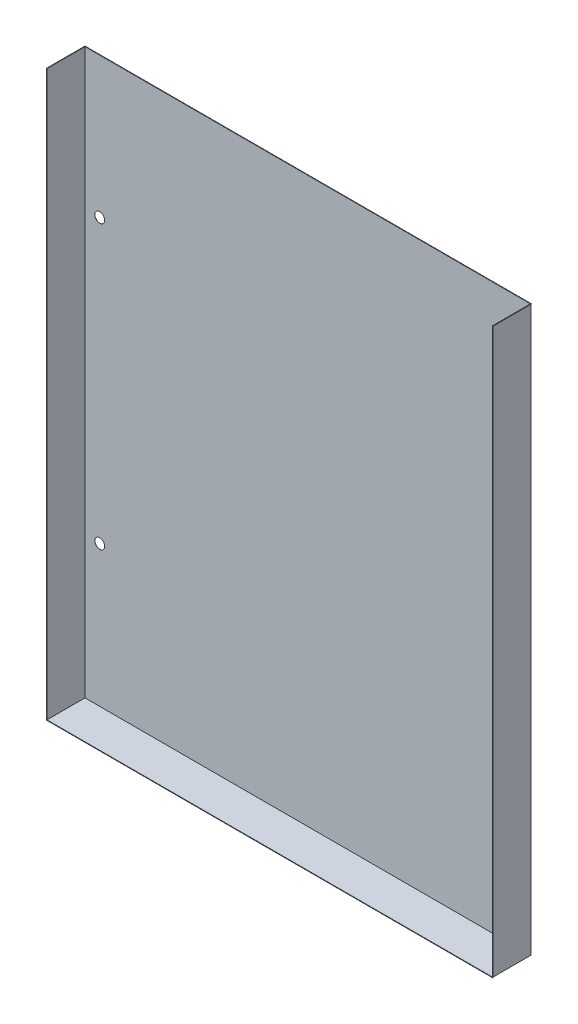
ISO-10303-21;
HEADER;
FILE_DESCRIPTION(('STEP AP214'),'2;1');
FILE_NAME('part.step','',(''),(''),'','','');
FILE_SCHEMA(('AUTOMOTIVE_DESIGN { 1 0 10303 214 1 1 1 1 }'));
ENDSEC;
DATA;
#1=APPLICATION_CONTEXT('core data for automotive mechanical design processes');
#2=APPLICATION_PROTOCOL_DEFINITION('international standard','automotive_design',2000,#1);
#3=PRODUCT_CONTEXT('',#1,'mechanical');
#4=PRODUCT('Part','Part','',(#3));
#5=PRODUCT_RELATED_PRODUCT_CATEGORY('part','',(#4));
#6=PRODUCT_DEFINITION_FORMATION('','',#4);
#7=PRODUCT_DEFINITION_CONTEXT('part definition',#1,'design');
#8=PRODUCT_DEFINITION('design','',#6,#7);
#9=PRODUCT_DEFINITION_SHAPE('','',#8);
#10=(LENGTH_UNIT() NAMED_UNIT(*) SI_UNIT(.MILLI.,.METRE.));
#11=(NAMED_UNIT(*) PLANE_ANGLE_UNIT() SI_UNIT($,.RADIAN.));
#12=(NAMED_UNIT(*) SI_UNIT($,.STERADIAN.) SOLID_ANGLE_UNIT());
#13=UNCERTAINTY_MEASURE_WITH_UNIT(LENGTH_MEASURE(1.E-05),#10,'distance_accuracy_value','');
#14=(GEOMETRIC_REPRESENTATION_CONTEXT(3) GLOBAL_UNCERTAINTY_ASSIGNED_CONTEXT((#13)) GLOBAL_UNIT_ASSIGNED_CONTEXT((#10,
#11,#12)) REPRESENTATION_CONTEXT('',''));
#15=CARTESIAN_POINT('',(0.,0.,0.));
#16=DIRECTION('',(0.,0.,1.));
#17=DIRECTION('',(1.,0.,0.));
#18=AXIS2_PLACEMENT_3D('',#15,#16,#17);
#19=CARTESIAN_POINT('',(-83.71996294,56.94427919,0.0686));
#20=DIRECTION('',(0.,0.,-1.));
#21=DIRECTION('',(-1.,0.,0.));
#22=AXIS2_PLACEMENT_3D('',#19,#20,#21);
#23=CYLINDRICAL_SURFACE('',#22,2.);
#24=CARTESIAN_POINT('',(-83.71996294,56.94427919,0.0686));
#25=DIRECTION('',(0.,0.,1.));
#26=DIRECTION('',(1.,0.,0.));
#27=AXIS2_PLACEMENT_3D('',#24,#25,#26);
#28=CIRCLE('',#27,2.);
#29=CARTESIAN_POINT('',(-81.71996294,56.94427919,0.0686));
#30=VERTEX_POINT('',#29);
#31=EDGE_CURVE('E361',#30,#30,#28,.T.);
#32=ORIENTED_EDGE('',*,*,#31,.T.);
#33=EDGE_LOOP('',(#32));
#34=FACE_BOUND('',#33,.T.);
#35=CARTESIAN_POINT('',(-83.71996294,56.94427919,0.));
#36=DIRECTION('',(0.,0.,1.));
#37=DIRECTION('',(1.,0.,0.));
#38=AXIS2_PLACEMENT_3D('',#35,#36,#37);
#39=CIRCLE('',#38,2.);
#40=CARTESIAN_POINT('',(-81.71996294,56.94427919,0.));
#41=VERTEX_POINT('',#40);
#42=EDGE_CURVE('E366',#41,#41,#39,.T.);
#43=ORIENTED_EDGE('',*,*,#42,.F.);
#44=EDGE_LOOP('',(#43));
#45=FACE_BOUND('',#44,.T.);
#46=ADVANCED_FACE('F37',(#34,#45),#23,.F.);
#47=CARTESIAN_POINT('',(-83.71996294,-56.7081132,0.0686));
#48=DIRECTION('',(0.,0.,-1.));
#49=DIRECTION('',(-1.,0.,0.));
#50=AXIS2_PLACEMENT_3D('',#47,#48,#49);
#51=CYLINDRICAL_SURFACE('',#50,2.);
#52=CARTESIAN_POINT('',(-83.71996294,-56.7081132,0.0686));
#53=DIRECTION('',(0.,0.,1.));
#54=DIRECTION('',(1.,0.,0.));
#55=AXIS2_PLACEMENT_3D('',#52,#53,#54);
#56=CIRCLE('',#55,2.);
#57=CARTESIAN_POINT('',(-81.71996294,-56.7081132,0.0686));
#58=VERTEX_POINT('',#57);
#59=EDGE_CURVE('E358',#58,#58,#56,.T.);
#60=ORIENTED_EDGE('',*,*,#59,.T.);
#61=EDGE_LOOP('',(#60));
#62=FACE_BOUND('',#61,.T.);
#63=CARTESIAN_POINT('',(-83.71996294,-56.7081132,0.));
#64=DIRECTION('',(0.,0.,1.));
#65=DIRECTION('',(1.,0.,0.));
#66=AXIS2_PLACEMENT_3D('',#63,#64,#65);
#67=CIRCLE('',#66,2.);
#68=CARTESIAN_POINT('',(-81.71996294,-56.7081132,0.));
#69=VERTEX_POINT('',#68);
#70=EDGE_CURVE('E264',#69,#69,#67,.T.);
#71=ORIENTED_EDGE('',*,*,#70,.F.);
#72=EDGE_LOOP('',(#71));
#73=FACE_BOUND('',#72,.T.);
#74=ADVANCED_FACE('F39',(#62,#73),#51,.F.);
#75=CARTESIAN_POINT('',(0.,0.,0.0686));
#76=DIRECTION('',(0.,0.,1.));
#77=DIRECTION('',(1.,0.,0.));
#78=AXIS2_PLACEMENT_3D('',#75,#76,#77);
#79=PLANE('',#78);
#80=ORIENTED_EDGE('',*,*,#59,.F.);
#81=EDGE_LOOP('',(#80));
#82=FACE_BOUND('',#81,.T.);
#83=ORIENTED_EDGE('',*,*,#31,.F.);
#84=EDGE_LOOP('',(#83));
#85=FACE_BOUND('',#84,.T.);
#86=DIRECTION('',(0.,1.,0.));
#87=VECTOR('',#86,1.);
#88=CARTESIAN_POINT('',(89.6514,0.,0.0686));
#89=LINE('',#88,#87);
#90=CARTESIAN_POINT('',(89.6514,-113.4657,0.0686000000000037));
#91=VERTEX_POINT('',#90);
#92=CARTESIAN_POINT('',(89.6514,113.5343,0.0686000000000003));
#93=VERTEX_POINT('',#92);
#94=EDGE_CURVE('E123',#91,#93,#89,.T.);
#95=ORIENTED_EDGE('',*,*,#94,.T.);
#96=DIRECTION('',(1.,0.,0.));
#97=VECTOR('',#96,1.);
#98=CARTESIAN_POINT('',(-89.6514,113.5343,0.0686000000000003));
#99=LINE('',#98,#97);
#100=CARTESIAN_POINT('',(-89.6514,113.5343,0.0686000000000003));
#101=VERTEX_POINT('',#100);
#102=EDGE_CURVE('E269',#101,#93,#99,.T.);
#103=ORIENTED_EDGE('',*,*,#102,.F.);
#104=DIRECTION('',(0.,1.,0.));
#105=VECTOR('',#104,1.);
#106=CARTESIAN_POINT('',(-89.6514,0.,0.0686));
#107=LINE('',#106,#105);
#108=CARTESIAN_POINT('',(-89.6514,-113.4657,0.0686000000000037));
#109=VERTEX_POINT('',#108);
#110=EDGE_CURVE('E46',#109,#101,#107,.T.);
#111=ORIENTED_EDGE('',*,*,#110,.F.);
#112=DIRECTION('',(1.,0.,0.));
#113=VECTOR('',#112,1.);
#114=CARTESIAN_POINT('',(0.,-113.4657,0.0686));
#115=LINE('',#114,#113);
#116=EDGE_CURVE('E11',#109,#91,#115,.T.);
#117=ORIENTED_EDGE('',*,*,#116,.T.);
#118=EDGE_LOOP('',(#95,#103,#111,#117));
#119=FACE_BOUND('',#118,.T.);
#120=CARTESIAN_POINT('',(83.71996294,-56.7081132,0.0686));
#121=DIRECTION('',(0.,0.,-1.));
#122=DIRECTION('',(-1.,0.,0.));
#123=AXIS2_PLACEMENT_3D('',#120,#121,#122);
#124=CIRCLE('',#123,2.);
#125=CARTESIAN_POINT('',(81.71996294,-56.7081132,0.0686));
#126=VERTEX_POINT('',#125);
#127=EDGE_CURVE('E154',#126,#126,#124,.T.);
#128=ORIENTED_EDGE('',*,*,#127,.T.);
#129=EDGE_LOOP('',(#128));
#130=FACE_BOUND('',#129,.T.);
#131=CARTESIAN_POINT('',(83.71996294,56.94427919,0.0686));
#132=DIRECTION('',(0.,0.,-1.));
#133=DIRECTION('',(-1.,0.,0.));
#134=AXIS2_PLACEMENT_3D('',#131,#132,#133);
#135=CIRCLE('',#134,2.);
#136=CARTESIAN_POINT('',(81.71996294,56.94427919,0.0686));
#137=VERTEX_POINT('',#136);
#138=EDGE_CURVE('E128',#137,#137,#135,.T.);
#139=ORIENTED_EDGE('',*,*,#138,.T.);
#140=EDGE_LOOP('',(#139));
#141=FACE_BOUND('',#140,.T.);
#142=ADVANCED_FACE('F290',(#82,#85,#119,#130,#141),#79,.T.);
#143=CARTESIAN_POINT('',(0.,0.,0.));
#144=DIRECTION('',(0.,0.,1.));
#145=DIRECTION('',(1.,0.,0.));
#146=AXIS2_PLACEMENT_3D('',#143,#144,#145);
#147=PLANE('',#146);
#148=DIRECTION('',(0.,-1.,0.));
#149=VECTOR('',#148,1.);
#150=CARTESIAN_POINT('',(89.72,113.4657,0.));
#151=LINE('',#150,#149);
#152=CARTESIAN_POINT('',(89.72,113.4657,0.));
#153=VERTEX_POINT('',#152);
#154=CARTESIAN_POINT('',(89.72,-113.5343,0.));
#155=VERTEX_POINT('',#154);
#156=EDGE_CURVE('E170',#153,#155,#151,.T.);
#157=ORIENTED_EDGE('',*,*,#156,.T.);
#158=DIRECTION('',(1.,0.,0.));
#159=VECTOR('',#158,1.);
#160=CARTESIAN_POINT('',(-89.72,-113.5343,0.));
#161=LINE('',#160,#159);
#162=CARTESIAN_POINT('',(-89.72,-113.5343,0.));
#163=VERTEX_POINT('',#162);
#164=EDGE_CURVE('E349',#163,#155,#161,.T.);
#165=ORIENTED_EDGE('',*,*,#164,.F.);
#166=DIRECTION('',(0.,-1.,0.));
#167=VECTOR('',#166,1.);
#168=CARTESIAN_POINT('',(-89.72,113.4657,0.));
#169=LINE('',#168,#167);
#170=CARTESIAN_POINT('',(-89.72,113.4657,0.));
#171=VERTEX_POINT('',#170);
#172=EDGE_CURVE('E351',#171,#163,#169,.T.);
#173=ORIENTED_EDGE('',*,*,#172,.F.);
#174=DIRECTION('',(1.,0.,0.));
#175=VECTOR('',#174,1.);
#176=CARTESIAN_POINT('',(0.,113.4657,0.));
#177=LINE('',#176,#175);
#178=EDGE_CURVE('E73',#171,#153,#177,.T.);
#179=ORIENTED_EDGE('',*,*,#178,.T.);
#180=EDGE_LOOP('',(#157,#165,#173,#179));
#181=FACE_BOUND('',#180,.T.);
#182=ORIENTED_EDGE('',*,*,#70,.T.);
#183=EDGE_LOOP('',(#182));
#184=FACE_BOUND('',#183,.T.);
#185=ORIENTED_EDGE('',*,*,#42,.T.);
#186=EDGE_LOOP('',(#185));
#187=FACE_BOUND('',#186,.T.);
#188=CARTESIAN_POINT('',(83.71996294,-56.7081132,0.));
#189=DIRECTION('',(0.,0.,-1.));
#190=DIRECTION('',(-1.,0.,0.));
#191=AXIS2_PLACEMENT_3D('',#188,#189,#190);
#192=CIRCLE('',#191,2.);
#193=CARTESIAN_POINT('',(81.71996294,-56.7081132,0.));
#194=VERTEX_POINT('',#193);
#195=EDGE_CURVE('E155',#194,#194,#192,.T.);
#196=ORIENTED_EDGE('',*,*,#195,.F.);
#197=EDGE_LOOP('',(#196));
#198=FACE_BOUND('',#197,.T.);
#199=CARTESIAN_POINT('',(83.71996294,56.94427919,0.));
#200=DIRECTION('',(0.,0.,-1.));
#201=DIRECTION('',(-1.,0.,0.));
#202=AXIS2_PLACEMENT_3D('',#199,#200,#201);
#203=CIRCLE('',#202,2.);
#204=CARTESIAN_POINT('',(81.71996294,56.94427919,0.));
#205=VERTEX_POINT('',#204);
#206=EDGE_CURVE('E151',#205,#205,#203,.T.);
#207=ORIENTED_EDGE('',*,*,#206,.F.);
#208=EDGE_LOOP('',(#207));
#209=FACE_BOUND('',#208,.T.);
#210=ADVANCED_FACE('F295',(#181,#184,#187,#198,#209),#147,.F.);
#211=CARTESIAN_POINT('',(0.,-113.4657,15.29686));
#212=DIRECTION('',(0.,-1.,0.));
#213=DIRECTION('',(0.,0.,-1.));
#214=AXIS2_PLACEMENT_3D('',#211,#212,#213);
#215=PLANE('',#214);
#216=ORIENTED_EDGE('',*,*,#116,.F.);
#217=DIRECTION('',(0.,0.,-1.));
#218=VECTOR('',#217,1.);
#219=CARTESIAN_POINT('',(-89.6514,-113.4657,15.29686));
#220=LINE('',#219,#218);
#221=CARTESIAN_POINT('',(-89.6514,-113.4657,15.36546));
#222=VERTEX_POINT('',#221);
#223=EDGE_CURVE('E259',#222,#109,#220,.T.);
#224=ORIENTED_EDGE('',*,*,#223,.F.);
#225=DIRECTION('',(-1.,0.,0.));
#226=VECTOR('',#225,1.);
#227=CARTESIAN_POINT('',(-89.6514,-113.4657,15.36546));
#228=LINE('',#227,#226);
#229=CARTESIAN_POINT('',(89.6514,-113.4657,15.36546));
#230=VERTEX_POINT('',#229);
#231=EDGE_CURVE('E137',#230,#222,#228,.T.);
#232=ORIENTED_EDGE('',*,*,#231,.F.);
#233=DIRECTION('',(0.,0.,-1.));
#234=VECTOR('',#233,1.);
#235=CARTESIAN_POINT('',(89.6514,-113.4657,15.29686));
#236=LINE('',#235,#234);
#237=EDGE_CURVE('E167',#230,#91,#236,.T.);
#238=ORIENTED_EDGE('',*,*,#237,.T.);
#239=EDGE_LOOP('',(#216,#224,#232,#238));
#240=FACE_BOUND('',#239,.T.);
#241=ADVANCED_FACE('F260',(#240),#215,.F.);
#242=CARTESIAN_POINT('',(-89.6514,-113.4657,15.29686));
#243=DIRECTION('',(-1.,0.,0.));
#244=DIRECTION('',(0.,0.,1.));
#245=AXIS2_PLACEMENT_3D('',#242,#243,#244);
#246=PLANE('',#245);
#247=ORIENTED_EDGE('',*,*,#110,.T.);
#248=DIRECTION('',(0.,0.,-1.));
#249=VECTOR('',#248,1.);
#250=CARTESIAN_POINT('',(-89.6514,113.5343,15.29686));
#251=LINE('',#250,#249);
#252=CARTESIAN_POINT('',(-89.6514,113.5343,15.36546));
#253=VERTEX_POINT('',#252);
#254=EDGE_CURVE('E116',#253,#101,#251,.T.);
#255=ORIENTED_EDGE('',*,*,#254,.F.);
#256=DIRECTION('',(0.,1.,0.));
#257=VECTOR('',#256,1.);
#258=CARTESIAN_POINT('',(-89.6514,113.5343,15.36546));
#259=LINE('',#258,#257);
#260=EDGE_CURVE('E125',#222,#253,#259,.T.);
#261=ORIENTED_EDGE('',*,*,#260,.F.);
#262=ORIENTED_EDGE('',*,*,#223,.T.);
#263=EDGE_LOOP('',(#247,#255,#261,#262));
#264=FACE_BOUND('',#263,.T.);
#265=ADVANCED_FACE('F266',(#264),#246,.F.);
#266=CARTESIAN_POINT('',(-89.72,113.4657,15.29686));
#267=DIRECTION('',(1.,0.,0.));
#268=DIRECTION('',(0.,0.,-1.));
#269=AXIS2_PLACEMENT_3D('',#266,#267,#268);
#270=PLANE('',#269);
#271=ORIENTED_EDGE('',*,*,#172,.T.);
#272=DIRECTION('',(0.,0.,-1.));
#273=VECTOR('',#272,1.);
#274=CARTESIAN_POINT('',(-89.72,-113.5343,15.29686));
#275=LINE('',#274,#273);
#276=CARTESIAN_POINT('',(-89.72,-113.5343,15.29686));
#277=VERTEX_POINT('',#276);
#278=EDGE_CURVE('E61',#277,#163,#275,.T.);
#279=ORIENTED_EDGE('',*,*,#278,.F.);
#280=DIRECTION('',(0.,-1.,0.));
#281=VECTOR('',#280,1.);
#282=CARTESIAN_POINT('',(-89.72,113.4657,15.29686));
#283=LINE('',#282,#281);
#284=CARTESIAN_POINT('',(-89.72,113.4657,15.29686));
#285=VERTEX_POINT('',#284);
#286=EDGE_CURVE('E347',#285,#277,#283,.T.);
#287=ORIENTED_EDGE('',*,*,#286,.F.);
#288=DIRECTION('',(0.,0.,-1.));
#289=VECTOR('',#288,1.);
#290=CARTESIAN_POINT('',(-89.72,113.4657,15.29686));
#291=LINE('',#290,#289);
#292=EDGE_CURVE('E77',#285,#171,#291,.T.);
#293=ORIENTED_EDGE('',*,*,#292,.T.);
#294=EDGE_LOOP('',(#271,#279,#287,#293));
#295=FACE_BOUND('',#294,.T.);
#296=ADVANCED_FACE('F306',(#295),#270,.F.);
#297=CARTESIAN_POINT('',(-89.72,-113.5343,15.29686));
#298=DIRECTION('',(0.,1.,0.));
#299=DIRECTION('',(0.,0.,1.));
#300=AXIS2_PLACEMENT_3D('',#297,#298,#299);
#301=PLANE('',#300);
#302=ORIENTED_EDGE('',*,*,#164,.T.);
#303=DIRECTION('',(0.,0.,-1.));
#304=VECTOR('',#303,1.);
#305=CARTESIAN_POINT('',(89.72,-113.5343,15.29686));
#306=LINE('',#305,#304);
#307=CARTESIAN_POINT('',(89.72,-113.5343,15.29686));
#308=VERTEX_POINT('',#307);
#309=EDGE_CURVE('E157',#308,#155,#306,.T.);
#310=ORIENTED_EDGE('',*,*,#309,.F.);
#311=DIRECTION('',(1.,0.,0.));
#312=VECTOR('',#311,1.);
#313=CARTESIAN_POINT('',(-89.72,-113.5343,15.29686));
#314=LINE('',#313,#312);
#315=EDGE_CURVE('E346',#277,#308,#314,.T.);
#316=ORIENTED_EDGE('',*,*,#315,.F.);
#317=ORIENTED_EDGE('',*,*,#278,.T.);
#318=EDGE_LOOP('',(#302,#310,#316,#317));
#319=FACE_BOUND('',#318,.T.);
#320=ADVANCED_FACE('F309',(#319),#301,.F.);
#321=CARTESIAN_POINT('',(0.,113.4657,0.));
#322=DIRECTION('',(0.,-1.,0.));
#323=DIRECTION('',(0.,0.,-1.));
#324=AXIS2_PLACEMENT_3D('',#321,#322,#323);
#325=PLANE('',#324);
#326=ORIENTED_EDGE('',*,*,#178,.F.);
#327=ORIENTED_EDGE('',*,*,#292,.F.);
#328=DIRECTION('',(1.,0.,0.));
#329=VECTOR('',#328,1.);
#330=CARTESIAN_POINT('',(-89.8724,113.4657,15.29686));
#331=LINE('',#330,#329);
#332=CARTESIAN_POINT('',(-89.8724,113.4657,15.29686));
#333=VERTEX_POINT('',#332);
#334=EDGE_CURVE('E110',#333,#285,#331,.T.);
#335=ORIENTED_EDGE('',*,*,#334,.F.);
#336=DIRECTION('',(0.,0.,1.));
#337=VECTOR('',#336,1.);
#338=CARTESIAN_POINT('',(-89.8724,113.4657,15.29686));
#339=LINE('',#338,#337);
#340=CARTESIAN_POINT('',(-89.8724,113.4657,-0.1524));
#341=VERTEX_POINT('',#340);
#342=EDGE_CURVE('E100',#341,#333,#339,.T.);
#343=ORIENTED_EDGE('',*,*,#342,.F.);
#344=DIRECTION('',(-1.,0.,0.));
#345=VECTOR('',#344,1.);
#346=CARTESIAN_POINT('',(-89.8724,113.4657,-0.1524));
#347=LINE('',#346,#345);
#348=CARTESIAN_POINT('',(89.8724,113.4657,-0.1524));
#349=VERTEX_POINT('',#348);
#350=EDGE_CURVE('E111',#349,#341,#347,.T.);
#351=ORIENTED_EDGE('',*,*,#350,.F.);
#352=DIRECTION('',(0.,0.,1.));
#353=VECTOR('',#352,1.);
#354=CARTESIAN_POINT('',(89.8724,113.4657,15.29686));
#355=LINE('',#354,#353);
#356=CARTESIAN_POINT('',(89.8724,113.4657,15.29686));
#357=VERTEX_POINT('',#356);
#358=EDGE_CURVE('E179',#349,#357,#355,.T.);
#359=ORIENTED_EDGE('',*,*,#358,.T.);
#360=DIRECTION('',(-1.,0.,0.));
#361=VECTOR('',#360,1.);
#362=CARTESIAN_POINT('',(89.8724,113.4657,15.29686));
#363=LINE('',#362,#361);
#364=CARTESIAN_POINT('',(89.72,113.4657,15.29686));
#365=VERTEX_POINT('',#364);
#366=EDGE_CURVE('E183',#357,#365,#363,.T.);
#367=ORIENTED_EDGE('',*,*,#366,.T.);
#368=DIRECTION('',(0.,0.,-1.));
#369=VECTOR('',#368,1.);
#370=CARTESIAN_POINT('',(89.72,113.4657,15.29686));
#371=LINE('',#370,#369);
#372=EDGE_CURVE('E165',#365,#153,#371,.T.);
#373=ORIENTED_EDGE('',*,*,#372,.T.);
#374=EDGE_LOOP('',(#326,#327,#335,#343,#351,#359,#367,#373));
#375=FACE_BOUND('',#374,.T.);
#376=ADVANCED_FACE('F113',(#375),#325,.T.);
#377=CARTESIAN_POINT('',(-89.8724,113.5343,-0.1524));
#378=DIRECTION('',(0.,0.,1.));
#379=DIRECTION('',(1.,0.,0.));
#380=AXIS2_PLACEMENT_3D('',#377,#378,#379);
#381=PLANE('',#380);
#382=ORIENTED_EDGE('',*,*,#350,.T.);
#383=DIRECTION('',(0.,-1.,0.));
#384=VECTOR('',#383,1.);
#385=CARTESIAN_POINT('',(-89.8724,113.5343,-0.1524));
#386=LINE('',#385,#384);
#387=CARTESIAN_POINT('',(-89.8724,113.5343,-0.1524));
#388=VERTEX_POINT('',#387);
#389=EDGE_CURVE('E108',#388,#341,#386,.T.);
#390=ORIENTED_EDGE('',*,*,#389,.F.);
#391=DIRECTION('',(-1.,0.,0.));
#392=VECTOR('',#391,1.);
#393=CARTESIAN_POINT('',(-89.8724,113.5343,-0.1524));
#394=LINE('',#393,#392);
#395=CARTESIAN_POINT('',(89.8724,113.5343,-0.1524));
#396=VERTEX_POINT('',#395);
#397=EDGE_CURVE('E85',#396,#388,#394,.T.);
#398=ORIENTED_EDGE('',*,*,#397,.F.);
#399=DIRECTION('',(0.,-1.,0.));
#400=VECTOR('',#399,1.);
#401=CARTESIAN_POINT('',(89.8724,113.5343,-0.1524));
#402=LINE('',#401,#400);
#403=EDGE_CURVE('E173',#396,#349,#402,.T.);
#404=ORIENTED_EDGE('',*,*,#403,.T.);
#405=EDGE_LOOP('',(#382,#390,#398,#404));
#406=FACE_BOUND('',#405,.T.);
#407=ADVANCED_FACE('F313',(#406),#381,.F.);
#408=CARTESIAN_POINT('',(-89.8724,113.5343,15.29686));
#409=DIRECTION('',(1.,0.,0.));
#410=DIRECTION('',(0.,0.,-1.));
#411=AXIS2_PLACEMENT_3D('',#408,#409,#410);
#412=PLANE('',#411);
#413=ORIENTED_EDGE('',*,*,#342,.T.);
#414=DIRECTION('',(0.,-1.,0.));
#415=VECTOR('',#414,1.);
#416=CARTESIAN_POINT('',(-89.8724,-113.6867,15.29686));
#417=LINE('',#416,#415);
#418=CARTESIAN_POINT('',(-89.8724,-113.6867,15.29686));
#419=VERTEX_POINT('',#418);
#420=EDGE_CURVE('E105',#333,#419,#417,.T.);
#421=ORIENTED_EDGE('',*,*,#420,.T.);
#422=DIRECTION('',(0.,0.,-1.));
#423=VECTOR('',#422,1.);
#424=CARTESIAN_POINT('',(-89.8724,-113.6867,15.36546));
#425=LINE('',#424,#423);
#426=CARTESIAN_POINT('',(-89.8724,-113.6867,15.36546));
#427=VERTEX_POINT('',#426);
#428=EDGE_CURVE('E133',#427,#419,#425,.T.);
#429=ORIENTED_EDGE('',*,*,#428,.F.);
#430=DIRECTION('',(0.,-1.,0.));
#431=VECTOR('',#430,1.);
#432=CARTESIAN_POINT('',(-89.8724,-113.6867,15.36546));
#433=LINE('',#432,#431);
#434=CARTESIAN_POINT('',(-89.8724,113.5343,15.36546));
#435=VERTEX_POINT('',#434);
#436=EDGE_CURVE('E143',#435,#427,#433,.T.);
#437=ORIENTED_EDGE('',*,*,#436,.F.);
#438=DIRECTION('',(0.,0.,1.));
#439=VECTOR('',#438,1.);
#440=CARTESIAN_POINT('',(-89.8724,113.5343,15.29686));
#441=LINE('',#440,#439);
#442=EDGE_CURVE('E270',#388,#435,#441,.T.);
#443=ORIENTED_EDGE('',*,*,#442,.F.);
#444=ORIENTED_EDGE('',*,*,#389,.T.);
#445=EDGE_LOOP('',(#413,#421,#429,#437,#443,#444));
#446=FACE_BOUND('',#445,.T.);
#447=ADVANCED_FACE('F101',(#446),#412,.F.);
#448=CARTESIAN_POINT('',(0.,113.5343,0.));
#449=DIRECTION('',(0.,-1.,0.));
#450=DIRECTION('',(0.,0.,-1.));
#451=AXIS2_PLACEMENT_3D('',#448,#449,#450);
#452=PLANE('',#451);
#453=ORIENTED_EDGE('',*,*,#254,.T.);
#454=ORIENTED_EDGE('',*,*,#102,.T.);
#455=DIRECTION('',(0.,0.,-1.));
#456=VECTOR('',#455,1.);
#457=CARTESIAN_POINT('',(89.6514,113.5343,15.29686));
#458=LINE('',#457,#456);
#459=CARTESIAN_POINT('',(89.6514,113.5343,15.36546));
#460=VERTEX_POINT('',#459);
#461=EDGE_CURVE('E182',#460,#93,#458,.T.);
#462=ORIENTED_EDGE('',*,*,#461,.F.);
#463=DIRECTION('',(1.,0.,0.));
#464=VECTOR('',#463,1.);
#465=CARTESIAN_POINT('',(89.8724,113.5343,15.36546));
#466=LINE('',#465,#464);
#467=CARTESIAN_POINT('',(89.8724,113.5343,15.36546));
#468=VERTEX_POINT('',#467);
#469=EDGE_CURVE('E193',#460,#468,#466,.T.);
#470=ORIENTED_EDGE('',*,*,#469,.T.);
#471=DIRECTION('',(0.,0.,1.));
#472=VECTOR('',#471,1.);
#473=CARTESIAN_POINT('',(89.8724,113.5343,15.29686));
#474=LINE('',#473,#472);
#475=EDGE_CURVE('E178',#396,#468,#474,.T.);
#476=ORIENTED_EDGE('',*,*,#475,.F.);
#477=ORIENTED_EDGE('',*,*,#397,.T.);
#478=ORIENTED_EDGE('',*,*,#442,.T.);
#479=DIRECTION('',(-1.,0.,0.));
#480=VECTOR('',#479,1.);
#481=CARTESIAN_POINT('',(-89.8724,113.5343,15.36546));
#482=LINE('',#481,#480);
#483=EDGE_CURVE('E146',#253,#435,#482,.T.);
#484=ORIENTED_EDGE('',*,*,#483,.F.);
#485=EDGE_LOOP('',(#453,#454,#462,#470,#476,#477,#478,#484));
#486=FACE_BOUND('',#485,.T.);
#487=ADVANCED_FACE('F220',(#486),#452,.F.);
#488=CARTESIAN_POINT('',(0.,0.,15.29686));
#489=DIRECTION('',(0.,0.,1.));
#490=DIRECTION('',(1.,0.,0.));
#491=AXIS2_PLACEMENT_3D('',#488,#489,#490);
#492=PLANE('',#491);
#493=ORIENTED_EDGE('',*,*,#420,.F.);
#494=ORIENTED_EDGE('',*,*,#334,.T.);
#495=ORIENTED_EDGE('',*,*,#286,.T.);
#496=ORIENTED_EDGE('',*,*,#315,.T.);
#497=DIRECTION('',(0.,-1.,0.));
#498=VECTOR('',#497,1.);
#499=CARTESIAN_POINT('',(89.72,113.4657,15.29686));
#500=LINE('',#499,#498);
#501=EDGE_CURVE('E169',#365,#308,#500,.T.);
#502=ORIENTED_EDGE('',*,*,#501,.F.);
#503=ORIENTED_EDGE('',*,*,#366,.F.);
#504=DIRECTION('',(0.,-1.,0.));
#505=VECTOR('',#504,1.);
#506=CARTESIAN_POINT('',(89.8724,-113.6867,15.29686));
#507=LINE('',#506,#505);
#508=CARTESIAN_POINT('',(89.8724,-113.6867,15.29686));
#509=VERTEX_POINT('',#508);
#510=EDGE_CURVE('E194',#357,#509,#507,.T.);
#511=ORIENTED_EDGE('',*,*,#510,.T.);
#512=DIRECTION('',(1.,0.,0.));
#513=VECTOR('',#512,1.);
#514=CARTESIAN_POINT('',(0.,-113.6867,15.29686));
#515=LINE('',#514,#513);
#516=EDGE_CURVE('E122',#419,#509,#515,.T.);
#517=ORIENTED_EDGE('',*,*,#516,.F.);
#518=EDGE_LOOP('',(#493,#494,#495,#496,#502,#503,#511,#517));
#519=FACE_BOUND('',#518,.T.);
#520=ADVANCED_FACE('F119',(#519),#492,.F.);
#521=CARTESIAN_POINT('',(0.,-113.6867,15.36546));
#522=DIRECTION('',(0.,1.,0.));
#523=DIRECTION('',(0.,0.,1.));
#524=AXIS2_PLACEMENT_3D('',#521,#522,#523);
#525=PLANE('',#524);
#526=ORIENTED_EDGE('',*,*,#516,.T.);
#527=DIRECTION('',(0.,0.,-1.));
#528=VECTOR('',#527,1.);
#529=CARTESIAN_POINT('',(89.8724,-113.6867,15.36546));
#530=LINE('',#529,#528);
#531=CARTESIAN_POINT('',(89.8724,-113.6867,15.36546));
#532=VERTEX_POINT('',#531);
#533=EDGE_CURVE('E186',#532,#509,#530,.T.);
#534=ORIENTED_EDGE('',*,*,#533,.F.);
#535=DIRECTION('',(1.,0.,0.));
#536=VECTOR('',#535,1.);
#537=CARTESIAN_POINT('',(0.,-113.6867,15.36546));
#538=LINE('',#537,#536);
#539=EDGE_CURVE('E140',#427,#532,#538,.T.);
#540=ORIENTED_EDGE('',*,*,#539,.F.);
#541=ORIENTED_EDGE('',*,*,#428,.T.);
#542=EDGE_LOOP('',(#526,#534,#540,#541));
#543=FACE_BOUND('',#542,.T.);
#544=ADVANCED_FACE('F275',(#543),#525,.F.);
#545=CARTESIAN_POINT('',(0.,0.,15.36546));
#546=DIRECTION('',(0.,0.,1.));
#547=DIRECTION('',(1.,0.,0.));
#548=AXIS2_PLACEMENT_3D('',#545,#546,#547);
#549=PLANE('',#548);
#550=ORIENTED_EDGE('',*,*,#260,.T.);
#551=ORIENTED_EDGE('',*,*,#483,.T.);
#552=ORIENTED_EDGE('',*,*,#436,.T.);
#553=ORIENTED_EDGE('',*,*,#539,.T.);
#554=DIRECTION('',(0.,-1.,0.));
#555=VECTOR('',#554,1.);
#556=CARTESIAN_POINT('',(89.8724,-113.6867,15.36546));
#557=LINE('',#556,#555);
#558=EDGE_CURVE('E199',#468,#532,#557,.T.);
#559=ORIENTED_EDGE('',*,*,#558,.F.);
#560=ORIENTED_EDGE('',*,*,#469,.F.);
#561=DIRECTION('',(0.,1.,0.));
#562=VECTOR('',#561,1.);
#563=CARTESIAN_POINT('',(89.6514,113.5343,15.36546));
#564=LINE('',#563,#562);
#565=EDGE_CURVE('E196',#230,#460,#564,.T.);
#566=ORIENTED_EDGE('',*,*,#565,.F.);
#567=ORIENTED_EDGE('',*,*,#231,.T.);
#568=EDGE_LOOP('',(#550,#551,#552,#553,#559,#560,#566,#567));
#569=FACE_BOUND('',#568,.T.);
#570=ADVANCED_FACE('F218',(#569),#549,.T.);
#571=CARTESIAN_POINT('',(83.71996294,56.94427919,0.0686));
#572=DIRECTION('',(0.,0.,-1.));
#573=DIRECTION('',(-1.,0.,0.));
#574=AXIS2_PLACEMENT_3D('',#571,#572,#573);
#575=CYLINDRICAL_SURFACE('',#574,2.);
#576=ORIENTED_EDGE('',*,*,#138,.F.);
#577=EDGE_LOOP('',(#576));
#578=FACE_BOUND('',#577,.T.);
#579=ORIENTED_EDGE('',*,*,#206,.T.);
#580=EDGE_LOOP('',(#579));
#581=FACE_BOUND('',#580,.T.);
#582=ADVANCED_FACE('F329',(#578,#581),#575,.F.);
#583=CARTESIAN_POINT('',(83.71996294,-56.7081132,0.0686));
#584=DIRECTION('',(0.,0.,-1.));
#585=DIRECTION('',(-1.,0.,0.));
#586=AXIS2_PLACEMENT_3D('',#583,#584,#585);
#587=CYLINDRICAL_SURFACE('',#586,2.);
#588=ORIENTED_EDGE('',*,*,#127,.F.);
#589=EDGE_LOOP('',(#588));
#590=FACE_BOUND('',#589,.T.);
#591=ORIENTED_EDGE('',*,*,#195,.T.);
#592=EDGE_LOOP('',(#591));
#593=FACE_BOUND('',#592,.T.);
#594=ADVANCED_FACE('F330',(#590,#593),#587,.F.);
#595=CARTESIAN_POINT('',(89.72,113.4657,15.29686));
#596=DIRECTION('',(1.,0.,0.));
#597=DIRECTION('',(0.,0.,-1.));
#598=AXIS2_PLACEMENT_3D('',#595,#596,#597);
#599=PLANE('',#598);
#600=ORIENTED_EDGE('',*,*,#156,.F.);
#601=ORIENTED_EDGE('',*,*,#372,.F.);
#602=ORIENTED_EDGE('',*,*,#501,.T.);
#603=ORIENTED_EDGE('',*,*,#309,.T.);
#604=EDGE_LOOP('',(#600,#601,#602,#603));
#605=FACE_BOUND('',#604,.T.);
#606=ADVANCED_FACE('F283',(#605),#599,.T.);
#607=CARTESIAN_POINT('',(89.6514,-113.4657,15.29686));
#608=DIRECTION('',(-1.,0.,0.));
#609=DIRECTION('',(0.,0.,1.));
#610=AXIS2_PLACEMENT_3D('',#607,#608,#609);
#611=PLANE('',#610);
#612=ORIENTED_EDGE('',*,*,#237,.F.);
#613=ORIENTED_EDGE('',*,*,#565,.T.);
#614=ORIENTED_EDGE('',*,*,#461,.T.);
#615=ORIENTED_EDGE('',*,*,#94,.F.);
#616=EDGE_LOOP('',(#612,#613,#614,#615));
#617=FACE_BOUND('',#616,.T.);
#618=ADVANCED_FACE('F208',(#617),#611,.T.);
#619=CARTESIAN_POINT('',(89.8724,113.5343,15.29686));
#620=DIRECTION('',(1.,0.,0.));
#621=DIRECTION('',(0.,0.,-1.));
#622=AXIS2_PLACEMENT_3D('',#619,#620,#621);
#623=PLANE('',#622);
#624=ORIENTED_EDGE('',*,*,#358,.F.);
#625=ORIENTED_EDGE('',*,*,#403,.F.);
#626=ORIENTED_EDGE('',*,*,#475,.T.);
#627=ORIENTED_EDGE('',*,*,#558,.T.);
#628=ORIENTED_EDGE('',*,*,#533,.T.);
#629=ORIENTED_EDGE('',*,*,#510,.F.);
#630=EDGE_LOOP('',(#624,#625,#626,#627,#628,#629));
#631=FACE_BOUND('',#630,.T.);
#632=ADVANCED_FACE('F277',(#631),#623,.T.);
#633=CLOSED_SHELL('',(#46,#74,#142,#210,#241,#265,#296,#320,#376,#407,#447,#487,#520,#544,#570,
#582,#594,#606,#618,#632));
#634=MANIFOLD_SOLID_BREP('B2',#633);
#635=ADVANCED_BREP_SHAPE_REPRESENTATION('',(#18,#634),#14);
#636=SHAPE_DEFINITION_REPRESENTATION(#9,#635);
ENDSEC;
END-ISO-10303-21;
